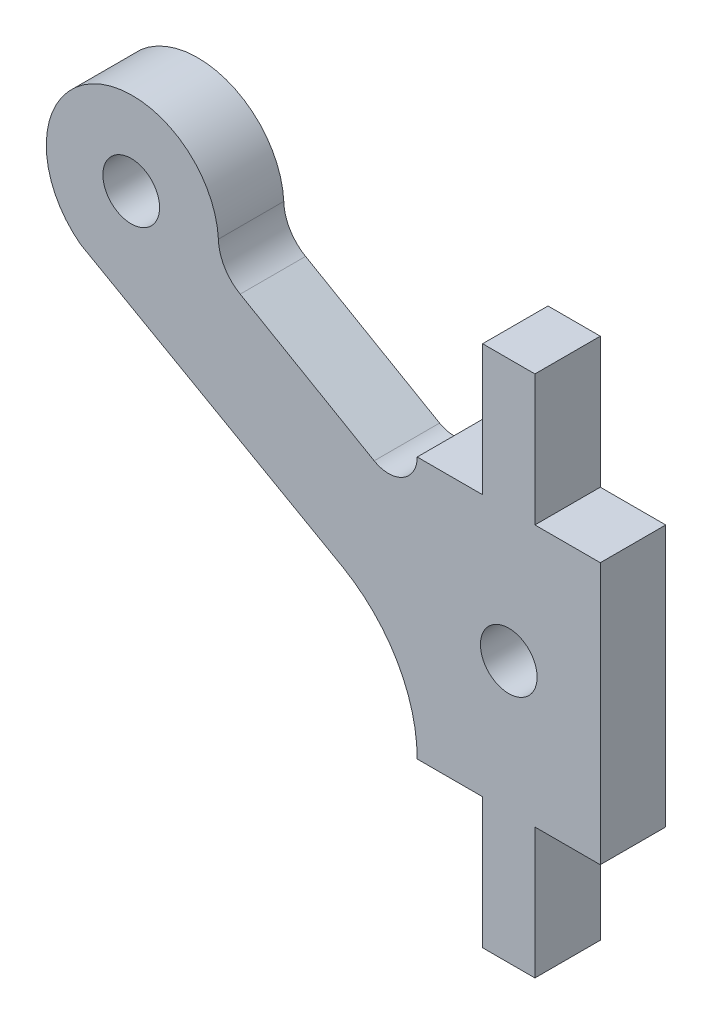
ISO-10303-21;
HEADER;
FILE_DESCRIPTION(('STEP AP214'),'2;1');
FILE_NAME('part.step','',(''),(''),'','','');
FILE_SCHEMA(('AUTOMOTIVE_DESIGN { 1 0 10303 214 1 1 1 1 }'));
ENDSEC;
DATA;
#1=APPLICATION_CONTEXT('core data for automotive mechanical design processes');
#2=APPLICATION_PROTOCOL_DEFINITION('international standard','automotive_design',2000,#1);
#3=PRODUCT_CONTEXT('',#1,'mechanical');
#4=PRODUCT('Part','Part','',(#3));
#5=PRODUCT_RELATED_PRODUCT_CATEGORY('part','',(#4));
#6=PRODUCT_DEFINITION_FORMATION('','',#4);
#7=PRODUCT_DEFINITION_CONTEXT('part definition',#1,'design');
#8=PRODUCT_DEFINITION('design','',#6,#7);
#9=PRODUCT_DEFINITION_SHAPE('','',#8);
#10=(LENGTH_UNIT() NAMED_UNIT(*) SI_UNIT(.MILLI.,.METRE.));
#11=(NAMED_UNIT(*) PLANE_ANGLE_UNIT() SI_UNIT($,.RADIAN.));
#12=(NAMED_UNIT(*) SI_UNIT($,.STERADIAN.) SOLID_ANGLE_UNIT());
#13=UNCERTAINTY_MEASURE_WITH_UNIT(LENGTH_MEASURE(1.E-05),#10,'distance_accuracy_value','');
#14=(GEOMETRIC_REPRESENTATION_CONTEXT(3) GLOBAL_UNCERTAINTY_ASSIGNED_CONTEXT((#13)) GLOBAL_UNIT_ASSIGNED_CONTEXT((#10,
#11,#12)) REPRESENTATION_CONTEXT('',''));
#15=CARTESIAN_POINT('',(0.,0.,0.));
#16=DIRECTION('',(0.,0.,1.));
#17=DIRECTION('',(1.,0.,0.));
#18=AXIS2_PLACEMENT_3D('',#15,#16,#17);
#19=CARTESIAN_POINT('',(64.5148019665248,47.6135134850686,3.));
#20=DIRECTION('',(0.,0.,-1.));
#21=DIRECTION('',(-1.,0.,0.));
#22=AXIS2_PLACEMENT_3D('',#19,#20,#21);
#23=CYLINDRICAL_SURFACE('',#22,1.31656698169403);
#24=CARTESIAN_POINT('',(64.5148019665248,47.6135134850686,0.));
#25=DIRECTION('',(0.,0.,1.));
#26=DIRECTION('',(1.,0.,0.));
#27=AXIS2_PLACEMENT_3D('',#24,#25,#26);
#28=CIRCLE('',#27,1.31656698169403);
#29=CARTESIAN_POINT('',(63.857215600445,46.4729308320211,0.));
#30=VERTEX_POINT('',#29);
#31=CARTESIAN_POINT('',(65.8313688500633,47.6130050987319,0.));
#32=VERTEX_POINT('',#31);
#33=EDGE_CURVE('E190',#30,#32,#28,.T.);
#34=ORIENTED_EDGE('',*,*,#33,.F.);
#35=DIRECTION('',(0.,0.,-1.));
#36=VECTOR('',#35,1.);
#37=CARTESIAN_POINT('',(63.857215600445,46.4729308320211,3.));
#38=LINE('',#37,#36);
#39=CARTESIAN_POINT('',(63.857215600445,46.4729308320211,3.));
#40=VERTEX_POINT('',#39);
#41=EDGE_CURVE('E11',#40,#30,#38,.T.);
#42=ORIENTED_EDGE('',*,*,#41,.F.);
#43=CARTESIAN_POINT('',(64.5148019665248,47.6135134850686,3.));
#44=DIRECTION('',(0.,0.,1.));
#45=DIRECTION('',(1.,0.,0.));
#46=AXIS2_PLACEMENT_3D('',#43,#44,#45);
#47=CIRCLE('',#46,1.31656698169403);
#48=CARTESIAN_POINT('',(65.8313688500633,47.6130050987319,3.));
#49=VERTEX_POINT('',#48);
#50=EDGE_CURVE('E235',#40,#49,#47,.T.);
#51=ORIENTED_EDGE('',*,*,#50,.T.);
#52=DIRECTION('',(0.,0.,-1.));
#53=VECTOR('',#52,1.);
#54=CARTESIAN_POINT('',(65.8313688500633,47.6130050987319,3.));
#55=LINE('',#54,#53);
#56=EDGE_CURVE('E114',#49,#32,#55,.T.);
#57=ORIENTED_EDGE('',*,*,#56,.T.);
#58=EDGE_LOOP('',(#34,#42,#51,#57));
#59=FACE_BOUND('',#58,.T.);
#60=ADVANCED_FACE('F36',(#59),#23,.F.);
#61=CARTESIAN_POINT('',(36.092585997996,62.5051629581796,3.));
#62=DIRECTION('',(-0.500054171191411,-0.86599412577342,0.));
#63=DIRECTION('',(0.865994125773421,-0.500054171191411,0.));
#64=AXIS2_PLACEMENT_3D('',#61,#62,#63);
#65=PLANE('',#64);
#66=DIRECTION('',(-0.865994125773421,0.500054171191411,0.));
#67=VECTOR('',#66,1.);
#68=CARTESIAN_POINT('',(36.092585997996,62.5051629581796,0.));
#69=LINE('',#68,#67);
#70=CARTESIAN_POINT('',(57.7102110563784,50.0224182605274,0.));
#71=VERTEX_POINT('',#70);
#72=EDGE_CURVE('E193',#30,#71,#69,.T.);
#73=ORIENTED_EDGE('',*,*,#72,.T.);
#74=DIRECTION('',(0.,0.,-1.));
#75=VECTOR('',#74,1.);
#76=CARTESIAN_POINT('',(57.7102110563784,50.0224182605274,3.));
#77=LINE('',#76,#75);
#78=CARTESIAN_POINT('',(57.7102110563784,50.0224182605274,3.));
#79=VERTEX_POINT('',#78);
#80=EDGE_CURVE('E44',#79,#71,#77,.T.);
#81=ORIENTED_EDGE('',*,*,#80,.F.);
#82=DIRECTION('',(-0.865994125773421,0.500054171191411,0.));
#83=VECTOR('',#82,1.);
#84=CARTESIAN_POINT('',(36.092585997996,62.5051629581796,3.));
#85=LINE('',#84,#83);
#86=EDGE_CURVE('E325',#40,#79,#85,.T.);
#87=ORIENTED_EDGE('',*,*,#86,.F.);
#88=ORIENTED_EDGE('',*,*,#41,.T.);
#89=EDGE_LOOP('',(#73,#81,#87,#88));
#90=FACE_BOUND('',#89,.T.);
#91=ADVANCED_FACE('F275',(#90),#65,.F.);
#92=CARTESIAN_POINT('',(58.7104442342044,51.7544374672506,3.));
#93=DIRECTION('',(0.,0.,-1.));
#94=DIRECTION('',(-1.,0.,0.));
#95=AXIS2_PLACEMENT_3D('',#92,#93,#94);
#96=CYLINDRICAL_SURFACE('',#95,2.00008923362984);
#97=CARTESIAN_POINT('',(58.7104442342044,51.7544374672506,0.));
#98=DIRECTION('',(0.,0.,1.));
#99=DIRECTION('',(1.,0.,0.));
#100=AXIS2_PLACEMENT_3D('',#97,#98,#99);
#101=CIRCLE('',#100,2.00008923362984);
#102=CARTESIAN_POINT('',(56.7109018023513,51.7076720344945,0.));
#103=VERTEX_POINT('',#102);
#104=EDGE_CURVE('E196',#103,#71,#101,.T.);
#105=ORIENTED_EDGE('',*,*,#104,.F.);
#106=DIRECTION('',(0.,0.,-1.));
#107=VECTOR('',#106,1.);
#108=CARTESIAN_POINT('',(56.7109018023513,51.7076720344945,3.));
#109=LINE('',#108,#107);
#110=CARTESIAN_POINT('',(56.7109018023513,51.7076720344945,3.));
#111=VERTEX_POINT('',#110);
#112=EDGE_CURVE('E265',#111,#103,#109,.T.);
#113=ORIENTED_EDGE('',*,*,#112,.F.);
#114=CARTESIAN_POINT('',(58.7104442342044,51.7544374672506,3.));
#115=DIRECTION('',(0.,0.,1.));
#116=DIRECTION('',(1.,0.,0.));
#117=AXIS2_PLACEMENT_3D('',#114,#115,#116);
#118=CIRCLE('',#117,2.00008923362984);
#119=EDGE_CURVE('E272',#111,#79,#118,.T.);
#120=ORIENTED_EDGE('',*,*,#119,.T.);
#121=ORIENTED_EDGE('',*,*,#80,.T.);
#122=EDGE_LOOP('',(#105,#113,#120,#121));
#123=FACE_BOUND('',#122,.T.);
#124=ADVANCED_FACE('F270',(#123),#96,.F.);
#125=CARTESIAN_POINT('',(52.7658377429486,51.4928158295167,3.));
#126=DIRECTION('',(0.,0.,-1.));
#127=DIRECTION('',(-1.,0.,0.));
#128=AXIS2_PLACEMENT_3D('',#125,#126,#127);
#129=CYLINDRICAL_SURFACE('',#128,3.95091048008037);
#130=CARTESIAN_POINT('',(52.7658377429486,51.4928158295167,0.));
#131=DIRECTION('',(0.,0.,1.));
#132=DIRECTION('',(1.,0.,0.));
#133=AXIS2_PLACEMENT_3D('',#130,#131,#132);
#134=CIRCLE('',#133,3.95091048008037);
#135=CARTESIAN_POINT('',(50.3935769559961,48.333374046496,0.));
#136=VERTEX_POINT('',#135);
#137=EDGE_CURVE('E199',#103,#136,#134,.T.);
#138=ORIENTED_EDGE('',*,*,#137,.T.);
#139=DIRECTION('',(0.,0.,-1.));
#140=VECTOR('',#139,1.);
#141=CARTESIAN_POINT('',(50.3935769559961,48.333374046496,3.));
#142=LINE('',#141,#140);
#143=CARTESIAN_POINT('',(50.3935769559961,48.333374046496,3.));
#144=VERTEX_POINT('',#143);
#145=EDGE_CURVE('E262',#144,#136,#142,.T.);
#146=ORIENTED_EDGE('',*,*,#145,.F.);
#147=CARTESIAN_POINT('',(52.7658377429486,51.4928158295167,3.));
#148=DIRECTION('',(0.,0.,1.));
#149=DIRECTION('',(1.,0.,0.));
#150=AXIS2_PLACEMENT_3D('',#147,#148,#149);
#151=CIRCLE('',#150,3.95091048008037);
#152=EDGE_CURVE('E293',#111,#144,#151,.T.);
#153=ORIENTED_EDGE('',*,*,#152,.F.);
#154=ORIENTED_EDGE('',*,*,#112,.T.);
#155=EDGE_LOOP('',(#138,#146,#153,#154));
#156=FACE_BOUND('',#155,.T.);
#157=ADVANCED_FACE('F283',(#156),#129,.T.);
#158=CARTESIAN_POINT('',(32.9344730371247,58.2112923073169,3.));
#159=DIRECTION('',(0.492424788612199,0.870355000881957,0.));
#160=DIRECTION('',(-0.870355000881957,0.492424788612199,0.));
#161=AXIS2_PLACEMENT_3D('',#158,#159,#160);
#162=PLANE('',#161);
#163=DIRECTION('',(0.870355000881957,-0.492424788612199,0.));
#164=VECTOR('',#163,1.);
#165=CARTESIAN_POINT('',(32.9344730371247,58.2112923073169,0.));
#166=LINE('',#165,#164);
#167=CARTESIAN_POINT('',(62.4143630778143,41.5323180877314,0.));
#168=VERTEX_POINT('',#167);
#169=EDGE_CURVE('E201',#136,#168,#166,.T.);
#170=ORIENTED_EDGE('',*,*,#169,.T.);
#171=DIRECTION('',(0.,0.,-1.));
#172=VECTOR('',#171,1.);
#173=CARTESIAN_POINT('',(62.4143630778143,41.5323180877314,3.));
#174=LINE('',#173,#172);
#175=CARTESIAN_POINT('',(62.4143630778143,41.5323180877314,3.));
#176=VERTEX_POINT('',#175);
#177=EDGE_CURVE('E260',#176,#168,#174,.T.);
#178=ORIENTED_EDGE('',*,*,#177,.F.);
#179=DIRECTION('',(0.870355000881957,-0.492424788612199,0.));
#180=VECTOR('',#179,1.);
#181=CARTESIAN_POINT('',(32.9344730371247,58.2112923073169,3.));
#182=LINE('',#181,#180);
#183=EDGE_CURVE('E289',#144,#176,#182,.T.);
#184=ORIENTED_EDGE('',*,*,#183,.F.);
#185=ORIENTED_EDGE('',*,*,#145,.T.);
#186=EDGE_LOOP('',(#170,#178,#184,#185));
#187=FACE_BOUND('',#186,.T.);
#188=ADVANCED_FACE('F287',(#187),#162,.F.);
#189=CARTESIAN_POINT('',(58.9967679013223,35.6135501662693,3.));
#190=DIRECTION('',(0.,0.,-1.));
#191=DIRECTION('',(-1.,0.,0.));
#192=AXIS2_PLACEMENT_3D('',#189,#190,#191);
#193=CYLINDRICAL_SURFACE('',#192,6.83460097580766);
#194=CARTESIAN_POINT('',(58.9967679013223,35.6135501662693,0.));
#195=DIRECTION('',(0.,0.,1.));
#196=DIRECTION('',(1.,0.,0.));
#197=AXIS2_PLACEMENT_3D('',#194,#195,#196);
#198=CIRCLE('',#197,6.83460097580766);
#199=CARTESIAN_POINT('',(65.8313688493938,35.6129344299414,0.));
#200=VERTEX_POINT('',#199);
#201=EDGE_CURVE('E204',#200,#168,#198,.T.);
#202=ORIENTED_EDGE('',*,*,#201,.F.);
#203=DIRECTION('',(0.,0.,-1.));
#204=VECTOR('',#203,1.);
#205=CARTESIAN_POINT('',(65.8313688493938,35.6129344299414,3.));
#206=LINE('',#205,#204);
#207=CARTESIAN_POINT('',(65.8313688493938,35.6129344299414,3.));
#208=VERTEX_POINT('',#207);
#209=EDGE_CURVE('E258',#208,#200,#206,.T.);
#210=ORIENTED_EDGE('',*,*,#209,.F.);
#211=CARTESIAN_POINT('',(58.9967679013223,35.6135501662693,3.));
#212=DIRECTION('',(0.,0.,1.));
#213=DIRECTION('',(1.,0.,0.));
#214=AXIS2_PLACEMENT_3D('',#211,#212,#213);
#215=CIRCLE('',#214,6.83460097580766);
#216=EDGE_CURVE('E292',#208,#176,#215,.T.);
#217=ORIENTED_EDGE('',*,*,#216,.T.);
#218=ORIENTED_EDGE('',*,*,#177,.T.);
#219=EDGE_LOOP('',(#202,#210,#217,#218));
#220=FACE_BOUND('',#219,.T.);
#221=ADVANCED_FACE('F341',(#220),#193,.F.);
#222=CARTESIAN_POINT('',(0.,35.6129344299414,3.));
#223=DIRECTION('',(0.,1.,0.));
#224=DIRECTION('',(0.,0.,1.));
#225=AXIS2_PLACEMENT_3D('',#222,#223,#224);
#226=PLANE('',#225);
#227=DIRECTION('',(1.,0.,0.));
#228=VECTOR('',#227,1.);
#229=CARTESIAN_POINT('',(0.,35.6129344299414,0.));
#230=LINE('',#229,#228);
#231=CARTESIAN_POINT('',(68.831386537728,35.6129344299414,0.));
#232=VERTEX_POINT('',#231);
#233=EDGE_CURVE('E207',#200,#232,#230,.T.);
#234=ORIENTED_EDGE('',*,*,#233,.T.);
#235=DIRECTION('',(0.,0.,-1.));
#236=VECTOR('',#235,1.);
#237=CARTESIAN_POINT('',(68.831386537728,35.6129344299414,3.));
#238=LINE('',#237,#236);
#239=CARTESIAN_POINT('',(68.831386537728,35.6129344299414,3.));
#240=VERTEX_POINT('',#239);
#241=EDGE_CURVE('E255',#240,#232,#238,.T.);
#242=ORIENTED_EDGE('',*,*,#241,.F.);
#243=DIRECTION('',(1.,0.,0.));
#244=VECTOR('',#243,1.);
#245=CARTESIAN_POINT('',(0.,35.6129344299414,3.));
#246=LINE('',#245,#244);
#247=EDGE_CURVE('E295',#208,#240,#246,.T.);
#248=ORIENTED_EDGE('',*,*,#247,.F.);
#249=ORIENTED_EDGE('',*,*,#209,.T.);
#250=EDGE_LOOP('',(#234,#242,#248,#249));
#251=FACE_BOUND('',#250,.T.);
#252=ADVANCED_FACE('F344',(#251),#226,.F.);
#253=CARTESIAN_POINT('',(68.8313865377281,1.5920925206317E-13,3.));
#254=DIRECTION('',(1.,0.,0.));
#255=DIRECTION('',(0.,1.,0.));
#256=AXIS2_PLACEMENT_3D('',#253,#254,#255);
#257=PLANE('',#256);
#258=DIRECTION('',(0.,-1.,0.));
#259=VECTOR('',#258,1.);
#260=CARTESIAN_POINT('',(68.8313865377281,1.5920925206317E-13,0.));
#261=LINE('',#260,#259);
#262=CARTESIAN_POINT('',(68.831386537728,29.6131111501409,0.));
#263=VERTEX_POINT('',#262);
#264=EDGE_CURVE('E209',#232,#263,#261,.T.);
#265=ORIENTED_EDGE('',*,*,#264,.T.);
#266=DIRECTION('',(0.,0.,-1.));
#267=VECTOR('',#266,1.);
#268=CARTESIAN_POINT('',(68.831386537728,29.6131111501409,3.));
#269=LINE('',#268,#267);
#270=CARTESIAN_POINT('',(68.831386537728,29.6131111501409,3.));
#271=VERTEX_POINT('',#270);
#272=EDGE_CURVE('E252',#271,#263,#269,.T.);
#273=ORIENTED_EDGE('',*,*,#272,.F.);
#274=DIRECTION('',(0.,-1.,0.));
#275=VECTOR('',#274,1.);
#276=CARTESIAN_POINT('',(68.8313865377281,1.5920925206317E-13,3.));
#277=LINE('',#276,#275);
#278=EDGE_CURVE('E301',#240,#271,#277,.T.);
#279=ORIENTED_EDGE('',*,*,#278,.F.);
#280=ORIENTED_EDGE('',*,*,#241,.T.);
#281=EDGE_LOOP('',(#265,#273,#279,#280));
#282=FACE_BOUND('',#281,.T.);
#283=ADVANCED_FACE('F348',(#282),#257,.F.);
#284=CARTESIAN_POINT('',(0.,29.6131111501408,3.));
#285=DIRECTION('',(0.,1.,0.));
#286=DIRECTION('',(-1.,0.,0.));
#287=AXIS2_PLACEMENT_3D('',#284,#285,#286);
#288=PLANE('',#287);
#289=DIRECTION('',(1.,0.,0.));
#290=VECTOR('',#289,1.);
#291=CARTESIAN_POINT('',(0.,29.6131111501408,0.));
#292=LINE('',#291,#290);
#293=CARTESIAN_POINT('',(71.2313865327697,29.6131111501409,0.));
#294=VERTEX_POINT('',#293);
#295=EDGE_CURVE('E211',#263,#294,#292,.T.);
#296=ORIENTED_EDGE('',*,*,#295,.T.);
#297=DIRECTION('',(0.,0.,-1.));
#298=VECTOR('',#297,1.);
#299=CARTESIAN_POINT('',(71.2313865327697,29.6131111501409,3.));
#300=LINE('',#299,#298);
#301=CARTESIAN_POINT('',(71.2313865327697,29.6131111501409,3.));
#302=VERTEX_POINT('',#301);
#303=EDGE_CURVE('E249',#302,#294,#300,.T.);
#304=ORIENTED_EDGE('',*,*,#303,.F.);
#305=DIRECTION('',(1.,0.,0.));
#306=VECTOR('',#305,1.);
#307=CARTESIAN_POINT('',(0.,29.6131111501408,3.));
#308=LINE('',#307,#306);
#309=EDGE_CURVE('E303',#271,#302,#308,.T.);
#310=ORIENTED_EDGE('',*,*,#309,.F.);
#311=ORIENTED_EDGE('',*,*,#272,.T.);
#312=EDGE_LOOP('',(#296,#304,#310,#311));
#313=FACE_BOUND('',#312,.T.);
#314=ADVANCED_FACE('F352',(#313),#288,.F.);
#315=CARTESIAN_POINT('',(71.2313865327697,0.,3.));
#316=DIRECTION('',(-1.,0.,0.));
#317=DIRECTION('',(0.,0.,1.));
#318=AXIS2_PLACEMENT_3D('',#315,#316,#317);
#319=PLANE('',#318);
#320=DIRECTION('',(0.,1.,0.));
#321=VECTOR('',#320,1.);
#322=CARTESIAN_POINT('',(71.2313865327697,0.,0.));
#323=LINE('',#322,#321);
#324=CARTESIAN_POINT('',(71.2313865327697,35.6131111501409,0.));
#325=VERTEX_POINT('',#324);
#326=EDGE_CURVE('E213',#294,#325,#323,.T.);
#327=ORIENTED_EDGE('',*,*,#326,.T.);
#328=DIRECTION('',(0.,0.,-1.));
#329=VECTOR('',#328,1.);
#330=CARTESIAN_POINT('',(71.2313865327697,35.6131111501409,3.));
#331=LINE('',#330,#329);
#332=CARTESIAN_POINT('',(71.2313865327697,35.6131111501409,3.));
#333=VERTEX_POINT('',#332);
#334=EDGE_CURVE('E246',#333,#325,#331,.T.);
#335=ORIENTED_EDGE('',*,*,#334,.F.);
#336=DIRECTION('',(0.,1.,0.));
#337=VECTOR('',#336,1.);
#338=CARTESIAN_POINT('',(71.2313865327697,0.,3.));
#339=LINE('',#338,#337);
#340=EDGE_CURVE('E305',#302,#333,#339,.T.);
#341=ORIENTED_EDGE('',*,*,#340,.F.);
#342=ORIENTED_EDGE('',*,*,#303,.T.);
#343=EDGE_LOOP('',(#327,#335,#341,#342));
#344=FACE_BOUND('',#343,.T.);
#345=ADVANCED_FACE('F356',(#344),#319,.F.);
#346=CARTESIAN_POINT('',(0.,35.6131111501409,3.));
#347=DIRECTION('',(0.,1.,0.));
#348=DIRECTION('',(0.,0.,1.));
#349=AXIS2_PLACEMENT_3D('',#346,#347,#348);
#350=PLANE('',#349);
#351=DIRECTION('',(1.,0.,0.));
#352=VECTOR('',#351,1.);
#353=CARTESIAN_POINT('',(0.,35.6131111501409,0.));
#354=LINE('',#353,#352);
#355=CARTESIAN_POINT('',(74.2313688493938,35.6131111501409,0.));
#356=VERTEX_POINT('',#355);
#357=EDGE_CURVE('E215',#325,#356,#354,.T.);
#358=ORIENTED_EDGE('',*,*,#357,.T.);
#359=DIRECTION('',(0.,0.,-1.));
#360=VECTOR('',#359,1.);
#361=CARTESIAN_POINT('',(74.2313688493938,35.6131111501409,3.));
#362=LINE('',#361,#360);
#363=CARTESIAN_POINT('',(74.2313688493938,35.6131111501409,3.));
#364=VERTEX_POINT('',#363);
#365=EDGE_CURVE('E244',#364,#356,#362,.T.);
#366=ORIENTED_EDGE('',*,*,#365,.F.);
#367=DIRECTION('',(1.,0.,0.));
#368=VECTOR('',#367,1.);
#369=CARTESIAN_POINT('',(0.,35.6131111501409,3.));
#370=LINE('',#369,#368);
#371=EDGE_CURVE('E307',#333,#364,#370,.T.);
#372=ORIENTED_EDGE('',*,*,#371,.F.);
#373=ORIENTED_EDGE('',*,*,#334,.T.);
#374=EDGE_LOOP('',(#358,#366,#372,#373));
#375=FACE_BOUND('',#374,.T.);
#376=ADVANCED_FACE('F360',(#375),#350,.F.);
#377=CARTESIAN_POINT('',(74.2313688493939,0.,3.));
#378=DIRECTION('',(1.,0.,0.));
#379=DIRECTION('',(0.,1.,0.));
#380=AXIS2_PLACEMENT_3D('',#377,#378,#379);
#381=PLANE('',#380);
#382=DIRECTION('',(0.,-1.,0.));
#383=VECTOR('',#382,1.);
#384=CARTESIAN_POINT('',(74.2313688493939,0.,0.));
#385=LINE('',#384,#383);
#386=CARTESIAN_POINT('',(74.2313688493938,47.6131111501409,0.));
#387=VERTEX_POINT('',#386);
#388=EDGE_CURVE('E218',#387,#356,#385,.T.);
#389=ORIENTED_EDGE('',*,*,#388,.F.);
#390=DIRECTION('',(0.,0.,-1.));
#391=VECTOR('',#390,1.);
#392=CARTESIAN_POINT('',(74.2313688493938,47.6131111501409,3.));
#393=LINE('',#392,#391);
#394=CARTESIAN_POINT('',(74.2313688493938,47.6131111501409,3.));
#395=VERTEX_POINT('',#394);
#396=EDGE_CURVE('E242',#395,#387,#393,.T.);
#397=ORIENTED_EDGE('',*,*,#396,.F.);
#398=DIRECTION('',(0.,-1.,0.));
#399=VECTOR('',#398,1.);
#400=CARTESIAN_POINT('',(74.2313688493939,0.,3.));
#401=LINE('',#400,#399);
#402=EDGE_CURVE('E309',#395,#364,#401,.T.);
#403=ORIENTED_EDGE('',*,*,#402,.T.);
#404=ORIENTED_EDGE('',*,*,#365,.T.);
#405=EDGE_LOOP('',(#389,#397,#403,#404));
#406=FACE_BOUND('',#405,.T.);
#407=ADVANCED_FACE('F364',(#406),#381,.T.);
#408=CARTESIAN_POINT('',(0.,47.6131111501409,3.));
#409=DIRECTION('',(0.,-1.,0.));
#410=DIRECTION('',(0.,0.,-1.));
#411=AXIS2_PLACEMENT_3D('',#408,#409,#410);
#412=PLANE('',#411);
#413=DIRECTION('',(-1.,0.,0.));
#414=VECTOR('',#413,1.);
#415=CARTESIAN_POINT('',(0.,47.6131111501409,0.));
#416=LINE('',#415,#414);
#417=CARTESIAN_POINT('',(71.2313865346286,47.6131111501409,0.));
#418=VERTEX_POINT('',#417);
#419=EDGE_CURVE('E221',#387,#418,#416,.T.);
#420=ORIENTED_EDGE('',*,*,#419,.T.);
#421=DIRECTION('',(0.,0.,-1.));
#422=VECTOR('',#421,1.);
#423=CARTESIAN_POINT('',(71.2313865346286,47.6131111501409,3.));
#424=LINE('',#423,#422);
#425=CARTESIAN_POINT('',(71.2313865346286,47.6131111501409,3.));
#426=VERTEX_POINT('',#425);
#427=EDGE_CURVE('E239',#426,#418,#424,.T.);
#428=ORIENTED_EDGE('',*,*,#427,.F.);
#429=DIRECTION('',(-1.,0.,0.));
#430=VECTOR('',#429,1.);
#431=CARTESIAN_POINT('',(0.,47.6131111501409,3.));
#432=LINE('',#431,#430);
#433=EDGE_CURVE('E312',#395,#426,#432,.T.);
#434=ORIENTED_EDGE('',*,*,#433,.F.);
#435=ORIENTED_EDGE('',*,*,#396,.T.);
#436=EDGE_LOOP('',(#420,#428,#434,#435));
#437=FACE_BOUND('',#436,.T.);
#438=ADVANCED_FACE('F317',(#437),#412,.F.);
#439=CARTESIAN_POINT('',(71.2313865346285,-1.64755677930664E-13,3.));
#440=DIRECTION('',(-1.,0.,0.));
#441=DIRECTION('',(0.,-1.,0.));
#442=AXIS2_PLACEMENT_3D('',#439,#440,#441);
#443=PLANE('',#442);
#444=DIRECTION('',(0.,1.,0.));
#445=VECTOR('',#444,1.);
#446=CARTESIAN_POINT('',(71.2313865346285,-1.64755677930664E-13,0.));
#447=LINE('',#446,#445);
#448=CARTESIAN_POINT('',(71.2313865346286,53.6131111501409,0.));
#449=VERTEX_POINT('',#448);
#450=EDGE_CURVE('E223',#418,#449,#447,.T.);
#451=ORIENTED_EDGE('',*,*,#450,.T.);
#452=DIRECTION('',(0.,0.,-1.));
#453=VECTOR('',#452,1.);
#454=CARTESIAN_POINT('',(71.2313865346286,53.6131111501409,3.));
#455=LINE('',#454,#453);
#456=CARTESIAN_POINT('',(71.2313865346286,53.6131111501409,3.));
#457=VERTEX_POINT('',#456);
#458=EDGE_CURVE('E176',#457,#449,#455,.T.);
#459=ORIENTED_EDGE('',*,*,#458,.F.);
#460=DIRECTION('',(0.,1.,0.));
#461=VECTOR('',#460,1.);
#462=CARTESIAN_POINT('',(71.2313865346285,-1.64755677930664E-13,3.));
#463=LINE('',#462,#461);
#464=EDGE_CURVE('E167',#426,#457,#463,.T.);
#465=ORIENTED_EDGE('',*,*,#464,.F.);
#466=ORIENTED_EDGE('',*,*,#427,.T.);
#467=EDGE_LOOP('',(#451,#459,#465,#466));
#468=FACE_BOUND('',#467,.T.);
#469=ADVANCED_FACE('F321',(#468),#443,.F.);
#470=CARTESIAN_POINT('',(0.,53.6131111501409,3.));
#471=DIRECTION('',(0.,-1.,0.));
#472=DIRECTION('',(0.,0.,-1.));
#473=AXIS2_PLACEMENT_3D('',#470,#471,#472);
#474=PLANE('',#473);
#475=DIRECTION('',(-1.,0.,0.));
#476=VECTOR('',#475,1.);
#477=CARTESIAN_POINT('',(0.,53.6131111501409,0.));
#478=LINE('',#477,#476);
#479=CARTESIAN_POINT('',(68.831386539587,53.6131111501409,0.));
#480=VERTEX_POINT('',#479);
#481=EDGE_CURVE('E175',#449,#480,#478,.T.);
#482=ORIENTED_EDGE('',*,*,#481,.T.);
#483=DIRECTION('',(0.,0.,-1.));
#484=VECTOR('',#483,1.);
#485=CARTESIAN_POINT('',(68.831386539587,53.6131111501409,3.));
#486=LINE('',#485,#484);
#487=CARTESIAN_POINT('',(68.831386539587,53.6131111501409,3.));
#488=VERTEX_POINT('',#487);
#489=EDGE_CURVE('E172',#488,#480,#486,.T.);
#490=ORIENTED_EDGE('',*,*,#489,.F.);
#491=DIRECTION('',(-1.,0.,0.));
#492=VECTOR('',#491,1.);
#493=CARTESIAN_POINT('',(0.,53.6131111501409,3.));
#494=LINE('',#493,#492);
#495=EDGE_CURVE('E160',#457,#488,#494,.T.);
#496=ORIENTED_EDGE('',*,*,#495,.F.);
#497=ORIENTED_EDGE('',*,*,#458,.T.);
#498=EDGE_LOOP('',(#482,#490,#496,#497));
#499=FACE_BOUND('',#498,.T.);
#500=ADVANCED_FACE('F173',(#499),#474,.F.);
#501=CARTESIAN_POINT('',(68.831386539587,0.,3.));
#502=DIRECTION('',(1.,0.,0.));
#503=DIRECTION('',(0.,0.,-1.));
#504=AXIS2_PLACEMENT_3D('',#501,#502,#503);
#505=PLANE('',#504);
#506=DIRECTION('',(0.,-1.,0.));
#507=VECTOR('',#506,1.);
#508=CARTESIAN_POINT('',(68.831386539587,0.,0.));
#509=LINE('',#508,#507);
#510=CARTESIAN_POINT('',(68.831386539587,47.6130050987319,0.));
#511=VERTEX_POINT('',#510);
#512=EDGE_CURVE('E107',#480,#511,#509,.T.);
#513=ORIENTED_EDGE('',*,*,#512,.T.);
#514=DIRECTION('',(0.,0.,-1.));
#515=VECTOR('',#514,1.);
#516=CARTESIAN_POINT('',(68.831386539587,47.6130050987319,3.));
#517=LINE('',#516,#515);
#518=CARTESIAN_POINT('',(68.831386539587,47.6130050987319,3.));
#519=VERTEX_POINT('',#518);
#520=EDGE_CURVE('E177',#519,#511,#517,.T.);
#521=ORIENTED_EDGE('',*,*,#520,.F.);
#522=DIRECTION('',(0.,-1.,0.));
#523=VECTOR('',#522,1.);
#524=CARTESIAN_POINT('',(68.831386539587,0.,3.));
#525=LINE('',#524,#523);
#526=EDGE_CURVE('E165',#488,#519,#525,.T.);
#527=ORIENTED_EDGE('',*,*,#526,.F.);
#528=ORIENTED_EDGE('',*,*,#489,.T.);
#529=EDGE_LOOP('',(#513,#521,#527,#528));
#530=FACE_BOUND('',#529,.T.);
#531=ADVANCED_FACE('F179',(#530),#505,.F.);
#532=CARTESIAN_POINT('',(52.7119794144234,51.6139799633634,3.));
#533=DIRECTION('',(0.,0.,-1.));
#534=DIRECTION('',(-1.,0.,0.));
#535=AXIS2_PLACEMENT_3D('',#532,#533,#534);
#536=CYLINDRICAL_SURFACE('',#535,1.30000480350406);
#537=CARTESIAN_POINT('',(52.7119794144234,51.6139799633634,3.));
#538=DIRECTION('',(0.,0.,1.));
#539=DIRECTION('',(1.,0.,0.));
#540=AXIS2_PLACEMENT_3D('',#537,#538,#539);
#541=CIRCLE('',#540,1.30000480350406);
#542=CARTESIAN_POINT('',(54.0119842179274,51.6139799633634,3.));
#543=VERTEX_POINT('',#542);
#544=EDGE_CURVE('E181',#543,#543,#541,.T.);
#545=ORIENTED_EDGE('',*,*,#544,.T.);
#546=EDGE_LOOP('',(#545));
#547=FACE_BOUND('',#546,.T.);
#548=CARTESIAN_POINT('',(52.7119794144234,51.6139799633634,0.));
#549=DIRECTION('',(0.,0.,1.));
#550=DIRECTION('',(1.,0.,0.));
#551=AXIS2_PLACEMENT_3D('',#548,#549,#550);
#552=CIRCLE('',#551,1.30000480350406);
#553=CARTESIAN_POINT('',(54.0119842179274,51.6139799633634,0.));
#554=VERTEX_POINT('',#553);
#555=EDGE_CURVE('E229',#554,#554,#552,.T.);
#556=ORIENTED_EDGE('',*,*,#555,.F.);
#557=EDGE_LOOP('',(#556));
#558=FACE_BOUND('',#557,.T.);
#559=ADVANCED_FACE('F377',(#547,#558),#536,.F.);
#560=CARTESIAN_POINT('',(0.,47.6130050987319,3.));
#561=DIRECTION('',(0.,-1.,0.));
#562=DIRECTION('',(0.,0.,-1.));
#563=AXIS2_PLACEMENT_3D('',#560,#561,#562);
#564=PLANE('',#563);
#565=DIRECTION('',(-1.,0.,0.));
#566=VECTOR('',#565,1.);
#567=CARTESIAN_POINT('',(0.,47.6130050987319,0.));
#568=LINE('',#567,#566);
#569=EDGE_CURVE('E227',#511,#32,#568,.T.);
#570=ORIENTED_EDGE('',*,*,#569,.T.);
#571=ORIENTED_EDGE('',*,*,#56,.F.);
#572=DIRECTION('',(-1.,0.,0.));
#573=VECTOR('',#572,1.);
#574=CARTESIAN_POINT('',(0.,47.6130050987319,3.));
#575=LINE('',#574,#573);
#576=EDGE_CURVE('E52',#519,#49,#575,.T.);
#577=ORIENTED_EDGE('',*,*,#576,.F.);
#578=ORIENTED_EDGE('',*,*,#520,.T.);
#579=EDGE_LOOP('',(#570,#571,#577,#578));
#580=FACE_BOUND('',#579,.T.);
#581=ADVANCED_FACE('F324',(#580),#564,.F.);
#582=CARTESIAN_POINT('',(70.0317754387803,41.612672770935,3.));
#583=DIRECTION('',(0.,0.,-1.));
#584=DIRECTION('',(-1.,0.,0.));
#585=AXIS2_PLACEMENT_3D('',#582,#583,#584);
#586=CYLINDRICAL_SURFACE('',#585,1.29999999999999);
#587=CARTESIAN_POINT('',(70.0317754387803,41.612672770935,3.));
#588=DIRECTION('',(0.,0.,1.));
#589=DIRECTION('',(1.,0.,0.));
#590=AXIS2_PLACEMENT_3D('',#587,#588,#589);
#591=CIRCLE('',#590,1.29999999999999);
#592=CARTESIAN_POINT('',(71.3317754387803,41.612672770935,3.));
#593=VERTEX_POINT('',#592);
#594=EDGE_CURVE('E187',#593,#593,#591,.T.);
#595=ORIENTED_EDGE('',*,*,#594,.T.);
#596=EDGE_LOOP('',(#595));
#597=FACE_BOUND('',#596,.T.);
#598=CARTESIAN_POINT('',(70.0317754387803,41.612672770935,0.));
#599=DIRECTION('',(0.,0.,1.));
#600=DIRECTION('',(1.,0.,0.));
#601=AXIS2_PLACEMENT_3D('',#598,#599,#600);
#602=CIRCLE('',#601,1.29999999999999);
#603=CARTESIAN_POINT('',(71.3317754387803,41.612672770935,0.));
#604=VERTEX_POINT('',#603);
#605=EDGE_CURVE('E232',#604,#604,#602,.T.);
#606=ORIENTED_EDGE('',*,*,#605,.F.);
#607=EDGE_LOOP('',(#606));
#608=FACE_BOUND('',#607,.T.);
#609=ADVANCED_FACE('F380',(#597,#608),#586,.F.);
#610=CARTESIAN_POINT('',(0.,0.,3.));
#611=DIRECTION('',(0.,0.,1.));
#612=DIRECTION('',(1.,0.,0.));
#613=AXIS2_PLACEMENT_3D('',#610,#611,#612);
#614=PLANE('',#613);
#615=ORIENTED_EDGE('',*,*,#50,.F.);
#616=ORIENTED_EDGE('',*,*,#86,.T.);
#617=ORIENTED_EDGE('',*,*,#119,.F.);
#618=ORIENTED_EDGE('',*,*,#152,.T.);
#619=ORIENTED_EDGE('',*,*,#183,.T.);
#620=ORIENTED_EDGE('',*,*,#216,.F.);
#621=ORIENTED_EDGE('',*,*,#247,.T.);
#622=ORIENTED_EDGE('',*,*,#278,.T.);
#623=ORIENTED_EDGE('',*,*,#309,.T.);
#624=ORIENTED_EDGE('',*,*,#340,.T.);
#625=ORIENTED_EDGE('',*,*,#371,.T.);
#626=ORIENTED_EDGE('',*,*,#402,.F.);
#627=ORIENTED_EDGE('',*,*,#433,.T.);
#628=ORIENTED_EDGE('',*,*,#464,.T.);
#629=ORIENTED_EDGE('',*,*,#495,.T.);
#630=ORIENTED_EDGE('',*,*,#526,.T.);
#631=ORIENTED_EDGE('',*,*,#576,.T.);
#632=EDGE_LOOP('',(#615,#616,#617,#618,#619,#620,#621,#622,#623,#624,#625,#626,#627,#628,#629,
#630,#631));
#633=FACE_BOUND('',#632,.T.);
#634=ORIENTED_EDGE('',*,*,#544,.F.);
#635=EDGE_LOOP('',(#634));
#636=FACE_BOUND('',#635,.T.);
#637=ORIENTED_EDGE('',*,*,#594,.F.);
#638=EDGE_LOOP('',(#637));
#639=FACE_BOUND('',#638,.T.);
#640=ADVANCED_FACE('F162',(#633,#636,#639),#614,.T.);
#641=CARTESIAN_POINT('',(0.,0.,0.));
#642=DIRECTION('',(0.,0.,1.));
#643=DIRECTION('',(1.,0.,0.));
#644=AXIS2_PLACEMENT_3D('',#641,#642,#643);
#645=PLANE('',#644);
#646=ORIENTED_EDGE('',*,*,#33,.T.);
#647=ORIENTED_EDGE('',*,*,#569,.F.);
#648=ORIENTED_EDGE('',*,*,#512,.F.);
#649=ORIENTED_EDGE('',*,*,#481,.F.);
#650=ORIENTED_EDGE('',*,*,#450,.F.);
#651=ORIENTED_EDGE('',*,*,#419,.F.);
#652=ORIENTED_EDGE('',*,*,#388,.T.);
#653=ORIENTED_EDGE('',*,*,#357,.F.);
#654=ORIENTED_EDGE('',*,*,#326,.F.);
#655=ORIENTED_EDGE('',*,*,#295,.F.);
#656=ORIENTED_EDGE('',*,*,#264,.F.);
#657=ORIENTED_EDGE('',*,*,#233,.F.);
#658=ORIENTED_EDGE('',*,*,#201,.T.);
#659=ORIENTED_EDGE('',*,*,#169,.F.);
#660=ORIENTED_EDGE('',*,*,#137,.F.);
#661=ORIENTED_EDGE('',*,*,#104,.T.);
#662=ORIENTED_EDGE('',*,*,#72,.F.);
#663=EDGE_LOOP('',(#646,#647,#648,#649,#650,#651,#652,#653,#654,#655,#656,#657,#658,#659,#660,
#661,#662));
#664=FACE_BOUND('',#663,.T.);
#665=ORIENTED_EDGE('',*,*,#555,.T.);
#666=EDGE_LOOP('',(#665));
#667=FACE_BOUND('',#666,.T.);
#668=ORIENTED_EDGE('',*,*,#605,.T.);
#669=EDGE_LOOP('',(#668));
#670=FACE_BOUND('',#669,.T.);
#671=ADVANCED_FACE('F278',(#664,#667,#670),#645,.F.);
#672=CLOSED_SHELL('',(#60,#91,#124,#157,#188,#221,#252,#283,#314,#345,#376,#407,#438,#469,#500,
#531,#559,#581,#609,#640,#671));
#673=MANIFOLD_SOLID_BREP('B2',#672);
#674=ADVANCED_BREP_SHAPE_REPRESENTATION('',(#18,#673),#14);
#675=SHAPE_DEFINITION_REPRESENTATION(#9,#674);
ENDSEC;
END-ISO-10303-21;
